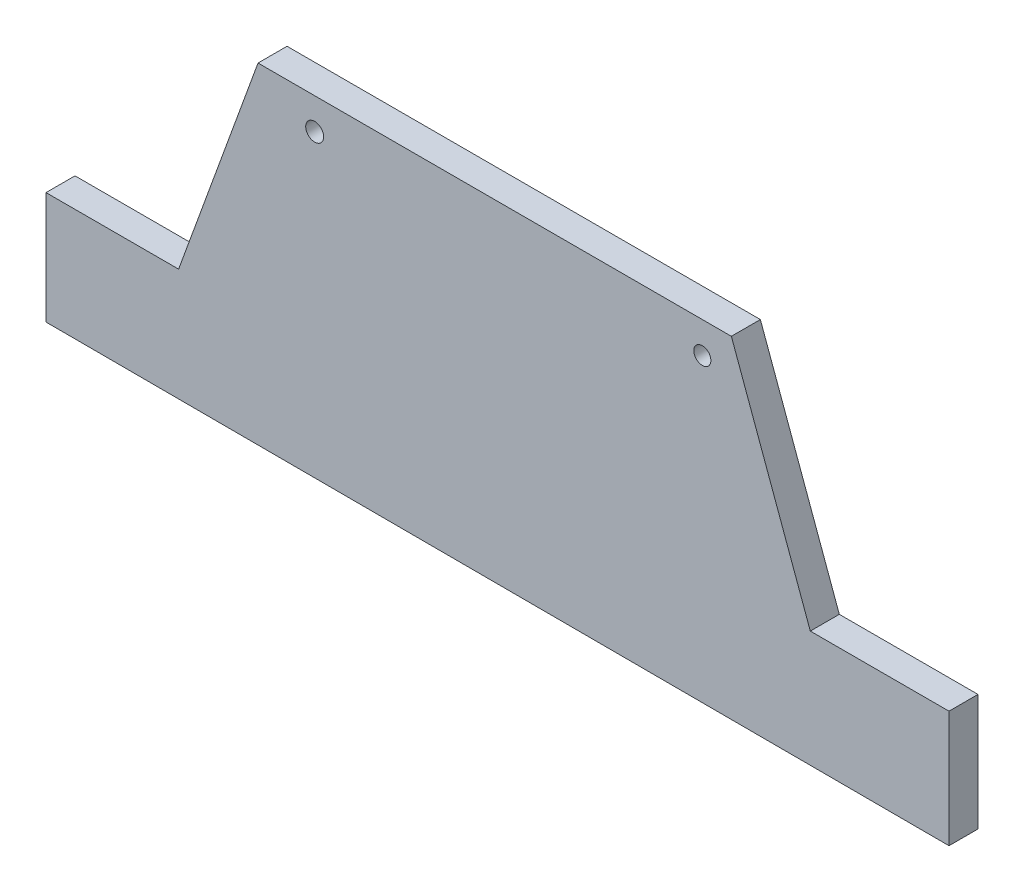
ISO-10303-21;
HEADER;
FILE_DESCRIPTION(('STEP AP214'),'2;1');
FILE_NAME('part.step','',(''),(''),'','','');
FILE_SCHEMA(('AUTOMOTIVE_DESIGN { 1 0 10303 214 1 1 1 1 }'));
ENDSEC;
DATA;
#1=APPLICATION_CONTEXT('core data for automotive mechanical design processes');
#2=APPLICATION_PROTOCOL_DEFINITION('international standard','automotive_design',2000,#1);
#3=PRODUCT_CONTEXT('',#1,'mechanical');
#4=PRODUCT('Part','Part','',(#3));
#5=PRODUCT_RELATED_PRODUCT_CATEGORY('part','',(#4));
#6=PRODUCT_DEFINITION_FORMATION('','',#4);
#7=PRODUCT_DEFINITION_CONTEXT('part definition',#1,'design');
#8=PRODUCT_DEFINITION('design','',#6,#7);
#9=PRODUCT_DEFINITION_SHAPE('','',#8);
#10=(LENGTH_UNIT() NAMED_UNIT(*) SI_UNIT(.MILLI.,.METRE.));
#11=(NAMED_UNIT(*) PLANE_ANGLE_UNIT() SI_UNIT($,.RADIAN.));
#12=(NAMED_UNIT(*) SI_UNIT($,.STERADIAN.) SOLID_ANGLE_UNIT());
#13=UNCERTAINTY_MEASURE_WITH_UNIT(LENGTH_MEASURE(1.E-05),#10,'distance_accuracy_value','');
#14=(GEOMETRIC_REPRESENTATION_CONTEXT(3) GLOBAL_UNCERTAINTY_ASSIGNED_CONTEXT((#13)) GLOBAL_UNIT_ASSIGNED_CONTEXT((#10,
#11,#12)) REPRESENTATION_CONTEXT('',''));
#15=CARTESIAN_POINT('',(0.,0.,0.));
#16=DIRECTION('',(0.,0.,1.));
#17=DIRECTION('',(1.,0.,0.));
#18=AXIS2_PLACEMENT_3D('',#15,#16,#17);
#19=CARTESIAN_POINT('',(167.483444874726,61.263371923883,-0.0001));
#20=DIRECTION('',(0.939142859872828,0.343526838471008,0.));
#21=DIRECTION('',(-0.343526838471008,0.939142859872828,0.));
#22=AXIS2_PLACEMENT_3D('',#19,#20,#21);
#23=PLANE('',#22);
#24=DIRECTION('',(0.,0.,1.));
#25=VECTOR('',#24,1.);
#26=CARTESIAN_POINT('',(136.012624896901,147.299141379528,-0.0001));
#27=LINE('',#26,#25);
#28=CARTESIAN_POINT('',(136.012624896901,147.299141379528,-0.0001));
#29=VERTEX_POINT('',#28);
#30=CARTESIAN_POINT('',(136.012624896901,147.299141379528,12.9338467982234));
#31=VERTEX_POINT('',#30);
#32=EDGE_CURVE('E41',#29,#31,#27,.T.);
#33=ORIENTED_EDGE('',*,*,#32,.T.);
#34=DIRECTION('',(-0.343526838471008,0.939142859872828,0.));
#35=VECTOR('',#34,1.);
#36=CARTESIAN_POINT('',(167.483444874726,61.263371923883,12.9338467982234));
#37=LINE('',#36,#35);
#38=CARTESIAN_POINT('',(171.212226027653,51.06953026835,12.9338467982234));
#39=VERTEX_POINT('',#38);
#40=EDGE_CURVE('E102',#39,#31,#37,.T.);
#41=ORIENTED_EDGE('',*,*,#40,.F.);
#42=DIRECTION('',(0.,0.,1.));
#43=VECTOR('',#42,1.);
#44=CARTESIAN_POINT('',(171.212226027653,51.06953026835,-0.0001));
#45=LINE('',#44,#43);
#46=CARTESIAN_POINT('',(171.212226027653,51.06953026835,-0.0001));
#47=VERTEX_POINT('',#46);
#48=EDGE_CURVE('E11',#47,#39,#45,.T.);
#49=ORIENTED_EDGE('',*,*,#48,.F.);
#50=DIRECTION('',(-0.343526838471008,0.939142859872828,0.));
#51=VECTOR('',#50,1.);
#52=CARTESIAN_POINT('',(167.483444874726,61.263371923883,-0.0001));
#53=LINE('',#52,#51);
#54=EDGE_CURVE('E103',#47,#29,#53,.T.);
#55=ORIENTED_EDGE('',*,*,#54,.T.);
#56=EDGE_LOOP('',(#33,#41,#49,#55));
#57=FACE_BOUND('',#56,.T.);
#58=ADVANCED_FACE('F37',(#57),#23,.T.);
#59=CARTESIAN_POINT('',(0.,51.0695302683499,-0.0001));
#60=DIRECTION('',(0.,1.,0.));
#61=DIRECTION('',(-1.,0.,0.));
#62=AXIS2_PLACEMENT_3D('',#59,#60,#61);
#63=PLANE('',#62);
#64=ORIENTED_EDGE('',*,*,#48,.T.);
#65=DIRECTION('',(-1.,0.,0.));
#66=VECTOR('',#65,1.);
#67=CARTESIAN_POINT('',(0.,51.0695302683499,12.9338467982234));
#68=LINE('',#67,#66);
#69=CARTESIAN_POINT('',(233.044157252322,51.06953026835,12.9338467982234));
#70=VERTEX_POINT('',#69);
#71=EDGE_CURVE('E121',#70,#39,#68,.T.);
#72=ORIENTED_EDGE('',*,*,#71,.F.);
#73=DIRECTION('',(0.,0.,1.));
#74=VECTOR('',#73,1.);
#75=CARTESIAN_POINT('',(233.044157252322,51.06953026835,-0.0001));
#76=LINE('',#75,#74);
#77=CARTESIAN_POINT('',(233.044157252322,51.06953026835,-0.0001));
#78=VERTEX_POINT('',#77);
#79=EDGE_CURVE('E46',#78,#70,#76,.T.);
#80=ORIENTED_EDGE('',*,*,#79,.F.);
#81=DIRECTION('',(-1.,0.,0.));
#82=VECTOR('',#81,1.);
#83=CARTESIAN_POINT('',(0.,51.0695302683499,-0.0001));
#84=LINE('',#83,#82);
#85=EDGE_CURVE('E108',#78,#47,#84,.T.);
#86=ORIENTED_EDGE('',*,*,#85,.T.);
#87=EDGE_LOOP('',(#64,#72,#80,#86));
#88=FACE_BOUND('',#87,.T.);
#89=ADVANCED_FACE('F194',(#88),#63,.T.);
#90=CARTESIAN_POINT('',(233.044157252322,0.,-0.0001));
#91=DIRECTION('',(1.,0.,0.));
#92=DIRECTION('',(0.,0.,-1.));
#93=AXIS2_PLACEMENT_3D('',#90,#91,#92);
#94=PLANE('',#93);
#95=ORIENTED_EDGE('',*,*,#79,.T.);
#96=DIRECTION('',(0.,1.,0.));
#97=VECTOR('',#96,1.);
#98=CARTESIAN_POINT('',(233.044157252322,0.,12.9338467982234));
#99=LINE('',#98,#97);
#100=CARTESIAN_POINT('',(233.044157252322,-0.895163773013796,12.9338467982234));
#101=VERTEX_POINT('',#100);
#102=EDGE_CURVE('E139',#101,#70,#99,.T.);
#103=ORIENTED_EDGE('',*,*,#102,.F.);
#104=DIRECTION('',(0.,0.,1.));
#105=VECTOR('',#104,1.);
#106=CARTESIAN_POINT('',(233.044157252322,-0.895163773013796,-0.0001));
#107=LINE('',#106,#105);
#108=CARTESIAN_POINT('',(233.044157252322,-0.895163773013796,-0.0001));
#109=VERTEX_POINT('',#108);
#110=EDGE_CURVE('E166',#109,#101,#107,.T.);
#111=ORIENTED_EDGE('',*,*,#110,.F.);
#112=DIRECTION('',(0.,1.,0.));
#113=VECTOR('',#112,1.);
#114=CARTESIAN_POINT('',(233.044157252322,0.,-0.0001));
#115=LINE('',#114,#113);
#116=EDGE_CURVE('E162',#109,#78,#115,.T.);
#117=ORIENTED_EDGE('',*,*,#116,.T.);
#118=EDGE_LOOP('',(#95,#103,#111,#117));
#119=FACE_BOUND('',#118,.T.);
#120=ADVANCED_FACE('F189',(#119),#94,.T.);
#121=CARTESIAN_POINT('',(-0.000838239385691122,-0.376998239181795,-0.0001));
#122=DIRECTION('',(-0.0022234515351859,-0.99999752812858,0.));
#123=DIRECTION('',(0.99999752812858,-0.0022234515351859,0.));
#124=AXIS2_PLACEMENT_3D('',#121,#122,#123);
#125=PLANE('',#124);
#126=ORIENTED_EDGE('',*,*,#110,.T.);
#127=DIRECTION('',(0.99999752812858,-0.0022234515351859,0.));
#128=VECTOR('',#127,1.);
#129=CARTESIAN_POINT('',(-0.000838239385691122,-0.376998239181795,12.9338467982234));
#130=LINE('',#129,#128);
#131=CARTESIAN_POINT('',(-169.555830252784,0.,12.9338467982234));
#132=VERTEX_POINT('',#131);
#133=EDGE_CURVE('E136',#132,#101,#130,.T.);
#134=ORIENTED_EDGE('',*,*,#133,.F.);
#135=DIRECTION('',(0.,0.,1.));
#136=VECTOR('',#135,1.);
#137=CARTESIAN_POINT('',(-169.555830252784,0.,-0.0001));
#138=LINE('',#137,#136);
#139=CARTESIAN_POINT('',(-169.555830252784,0.,-0.0001));
#140=VERTEX_POINT('',#139);
#141=EDGE_CURVE('E168',#140,#132,#138,.T.);
#142=ORIENTED_EDGE('',*,*,#141,.F.);
#143=DIRECTION('',(0.99999752812858,-0.0022234515351859,0.));
#144=VECTOR('',#143,1.);
#145=CARTESIAN_POINT('',(-0.000838239385691122,-0.376998239181795,-0.0001));
#146=LINE('',#145,#144);
#147=EDGE_CURVE('E159',#140,#109,#146,.T.);
#148=ORIENTED_EDGE('',*,*,#147,.T.);
#149=EDGE_LOOP('',(#126,#134,#142,#148));
#150=FACE_BOUND('',#149,.T.);
#151=ADVANCED_FACE('F201',(#150),#125,.T.);
#152=CARTESIAN_POINT('',(-169.555830252784,0.,-0.0001));
#153=DIRECTION('',(1.,0.,0.));
#154=DIRECTION('',(0.,0.,-1.));
#155=AXIS2_PLACEMENT_3D('',#152,#153,#154);
#156=PLANE('',#155);
#157=ORIENTED_EDGE('',*,*,#141,.T.);
#158=DIRECTION('',(0.,1.,0.));
#159=VECTOR('',#158,1.);
#160=CARTESIAN_POINT('',(-169.555830252784,0.,12.9338467982234));
#161=LINE('',#160,#159);
#162=CARTESIAN_POINT('',(-169.555830252784,50.,12.9338467982234));
#163=VERTEX_POINT('',#162);
#164=EDGE_CURVE('E133',#132,#163,#161,.T.);
#165=ORIENTED_EDGE('',*,*,#164,.T.);
#166=DIRECTION('',(0.,0.,1.));
#167=VECTOR('',#166,1.);
#168=CARTESIAN_POINT('',(-169.555830252784,50.,-0.0001));
#169=LINE('',#168,#167);
#170=CARTESIAN_POINT('',(-169.555830252784,50.,-0.0001));
#171=VERTEX_POINT('',#170);
#172=EDGE_CURVE('E170',#171,#163,#169,.T.);
#173=ORIENTED_EDGE('',*,*,#172,.F.);
#174=DIRECTION('',(0.,1.,0.));
#175=VECTOR('',#174,1.);
#176=CARTESIAN_POINT('',(-169.555830252784,0.,-0.0001));
#177=LINE('',#176,#175);
#178=EDGE_CURVE('E156',#140,#171,#177,.T.);
#179=ORIENTED_EDGE('',*,*,#178,.F.);
#180=EDGE_LOOP('',(#157,#165,#173,#179));
#181=FACE_BOUND('',#180,.T.);
#182=ADVANCED_FACE('F183',(#181),#156,.F.);
#183=CARTESIAN_POINT('',(0.,50.,-0.0001));
#184=DIRECTION('',(0.,-1.,0.));
#185=DIRECTION('',(0.,0.,-1.));
#186=AXIS2_PLACEMENT_3D('',#183,#184,#185);
#187=PLANE('',#186);
#188=ORIENTED_EDGE('',*,*,#172,.T.);
#189=DIRECTION('',(1.,0.,0.));
#190=VECTOR('',#189,1.);
#191=CARTESIAN_POINT('',(0.,50.,12.9338467982234));
#192=LINE('',#191,#190);
#193=CARTESIAN_POINT('',(-110.431982128087,50.,12.9338467982234));
#194=VERTEX_POINT('',#193);
#195=EDGE_CURVE('E130',#163,#194,#192,.T.);
#196=ORIENTED_EDGE('',*,*,#195,.T.);
#197=DIRECTION('',(0.,0.,1.));
#198=VECTOR('',#197,1.);
#199=CARTESIAN_POINT('',(-110.431982128087,50.,-0.0001));
#200=LINE('',#199,#198);
#201=CARTESIAN_POINT('',(-110.431982128087,50.,-0.0001));
#202=VERTEX_POINT('',#201);
#203=EDGE_CURVE('E172',#202,#194,#200,.T.);
#204=ORIENTED_EDGE('',*,*,#203,.F.);
#205=DIRECTION('',(1.,0.,0.));
#206=VECTOR('',#205,1.);
#207=CARTESIAN_POINT('',(0.,50.,-0.0001));
#208=LINE('',#207,#206);
#209=EDGE_CURVE('E153',#171,#202,#208,.T.);
#210=ORIENTED_EDGE('',*,*,#209,.F.);
#211=EDGE_LOOP('',(#188,#196,#204,#210));
#212=FACE_BOUND('',#211,.T.);
#213=ADVANCED_FACE('F179',(#212),#187,.F.);
#214=CARTESIAN_POINT('',(-113.583584432125,41.341043834555,-0.0001));
#215=DIRECTION('',(0.93969262078591,-0.342020143325665,0.));
#216=DIRECTION('',(0.342020143325665,0.93969262078591,0.));
#217=AXIS2_PLACEMENT_3D('',#214,#215,#216);
#218=PLANE('',#217);
#219=ORIENTED_EDGE('',*,*,#203,.T.);
#220=DIRECTION('',(0.342020143325665,0.93969262078591,0.));
#221=VECTOR('',#220,1.);
#222=CARTESIAN_POINT('',(-113.583584432125,41.341043834555,12.9338467982234));
#223=LINE('',#222,#221);
#224=CARTESIAN_POINT('',(-75.0179908462803,147.299141379528,12.9338467982234));
#225=VERTEX_POINT('',#224);
#226=EDGE_CURVE('E116',#194,#225,#223,.T.);
#227=ORIENTED_EDGE('',*,*,#226,.T.);
#228=DIRECTION('',(0.,0.,1.));
#229=VECTOR('',#228,1.);
#230=CARTESIAN_POINT('',(-75.0179908462803,147.299141379528,-0.0001));
#231=LINE('',#230,#229);
#232=CARTESIAN_POINT('',(-75.0179908462803,147.299141379528,-0.0001));
#233=VERTEX_POINT('',#232);
#234=EDGE_CURVE('E107',#233,#225,#231,.T.);
#235=ORIENTED_EDGE('',*,*,#234,.F.);
#236=DIRECTION('',(0.342020143325665,0.93969262078591,0.));
#237=VECTOR('',#236,1.);
#238=CARTESIAN_POINT('',(-113.583584432125,41.341043834555,-0.0001));
#239=LINE('',#238,#237);
#240=EDGE_CURVE('E151',#202,#233,#239,.T.);
#241=ORIENTED_EDGE('',*,*,#240,.F.);
#242=EDGE_LOOP('',(#219,#227,#235,#241));
#243=FACE_BOUND('',#242,.T.);
#244=ADVANCED_FACE('F175',(#243),#218,.F.);
#245=CARTESIAN_POINT('',(-49.7678283916644,133.392636667386,-0.0001));
#246=DIRECTION('',(0.,0.,1.));
#247=DIRECTION('',(1.,0.,0.));
#248=AXIS2_PLACEMENT_3D('',#245,#246,#247);
#249=CYLINDRICAL_SURFACE('',#248,4.00000000000001);
#250=CARTESIAN_POINT('',(-49.7678283916644,133.392636667386,-0.0001));
#251=DIRECTION('',(0.,0.,1.));
#252=DIRECTION('',(1.,0.,0.));
#253=AXIS2_PLACEMENT_3D('',#250,#251,#252);
#254=CIRCLE('',#253,4.00000000000001);
#255=CARTESIAN_POINT('',(-45.7678283916644,133.392636667386,-0.0001));
#256=VERTEX_POINT('',#255);
#257=EDGE_CURVE('E145',#256,#256,#254,.T.);
#258=ORIENTED_EDGE('',*,*,#257,.F.);
#259=EDGE_LOOP('',(#258));
#260=FACE_BOUND('',#259,.T.);
#261=CARTESIAN_POINT('',(-49.7678283916644,133.392636667386,12.9338467982234));
#262=DIRECTION('',(0.,0.,1.));
#263=DIRECTION('',(1.,0.,0.));
#264=AXIS2_PLACEMENT_3D('',#261,#262,#263);
#265=CIRCLE('',#264,4.00000000000001);
#266=CARTESIAN_POINT('',(-45.7678283916644,133.392636667386,12.9338467982234));
#267=VERTEX_POINT('',#266);
#268=EDGE_CURVE('E122',#267,#267,#265,.T.);
#269=ORIENTED_EDGE('',*,*,#268,.T.);
#270=EDGE_LOOP('',(#269));
#271=FACE_BOUND('',#270,.T.);
#272=ADVANCED_FACE('F215',(#260,#271),#249,.F.);
#273=CARTESIAN_POINT('',(123.066759463111,133.392636667386,-0.0001));
#274=DIRECTION('',(0.,0.,1.));
#275=DIRECTION('',(1.,0.,0.));
#276=AXIS2_PLACEMENT_3D('',#273,#274,#275);
#277=CYLINDRICAL_SURFACE('',#276,3.81750849365083);
#278=CARTESIAN_POINT('',(123.066759463111,133.392636667386,-0.0001));
#279=DIRECTION('',(0.,0.,1.));
#280=DIRECTION('',(1.,0.,0.));
#281=AXIS2_PLACEMENT_3D('',#278,#279,#280);
#282=CIRCLE('',#281,3.81750849365083);
#283=CARTESIAN_POINT('',(126.884267956762,133.392636667386,-0.0001));
#284=VERTEX_POINT('',#283);
#285=EDGE_CURVE('E142',#284,#284,#282,.T.);
#286=ORIENTED_EDGE('',*,*,#285,.F.);
#287=EDGE_LOOP('',(#286));
#288=FACE_BOUND('',#287,.T.);
#289=CARTESIAN_POINT('',(123.066759463111,133.392636667386,12.9338467982234));
#290=DIRECTION('',(0.,0.,1.));
#291=DIRECTION('',(1.,0.,0.));
#292=AXIS2_PLACEMENT_3D('',#289,#290,#291);
#293=CIRCLE('',#292,3.81750849365083);
#294=CARTESIAN_POINT('',(126.884267956762,133.392636667386,12.9338467982234));
#295=VERTEX_POINT('',#294);
#296=EDGE_CURVE('E125',#295,#295,#293,.T.);
#297=ORIENTED_EDGE('',*,*,#296,.T.);
#298=EDGE_LOOP('',(#297));
#299=FACE_BOUND('',#298,.T.);
#300=ADVANCED_FACE('F39',(#288,#299),#277,.F.);
#301=CARTESIAN_POINT('',(0.,147.299141379528,-0.0001));
#302=DIRECTION('',(0.,1.,0.));
#303=DIRECTION('',(0.,0.,1.));
#304=AXIS2_PLACEMENT_3D('',#301,#302,#303);
#305=PLANE('',#304);
#306=ORIENTED_EDGE('',*,*,#234,.T.);
#307=DIRECTION('',(-1.,0.,0.));
#308=VECTOR('',#307,1.);
#309=CARTESIAN_POINT('',(0.,147.299141379528,12.9338467982234));
#310=LINE('',#309,#308);
#311=EDGE_CURVE('E110',#31,#225,#310,.T.);
#312=ORIENTED_EDGE('',*,*,#311,.F.);
#313=ORIENTED_EDGE('',*,*,#32,.F.);
#314=DIRECTION('',(-1.,0.,0.));
#315=VECTOR('',#314,1.);
#316=CARTESIAN_POINT('',(0.,147.299141379528,-0.0001));
#317=LINE('',#316,#315);
#318=EDGE_CURVE('E149',#29,#233,#317,.T.);
#319=ORIENTED_EDGE('',*,*,#318,.T.);
#320=EDGE_LOOP('',(#306,#312,#313,#319));
#321=FACE_BOUND('',#320,.T.);
#322=ADVANCED_FACE('F111',(#321),#305,.T.);
#323=CARTESIAN_POINT('',(0.,0.,-0.0001));
#324=DIRECTION('',(0.,0.,1.));
#325=DIRECTION('',(1.,0.,0.));
#326=AXIS2_PLACEMENT_3D('',#323,#324,#325);
#327=PLANE('',#326);
#328=ORIENTED_EDGE('',*,*,#285,.T.);
#329=EDGE_LOOP('',(#328));
#330=FACE_BOUND('',#329,.T.);
#331=ORIENTED_EDGE('',*,*,#257,.T.);
#332=EDGE_LOOP('',(#331));
#333=FACE_BOUND('',#332,.T.);
#334=ORIENTED_EDGE('',*,*,#54,.F.);
#335=ORIENTED_EDGE('',*,*,#85,.F.);
#336=ORIENTED_EDGE('',*,*,#116,.F.);
#337=ORIENTED_EDGE('',*,*,#147,.F.);
#338=ORIENTED_EDGE('',*,*,#178,.T.);
#339=ORIENTED_EDGE('',*,*,#209,.T.);
#340=ORIENTED_EDGE('',*,*,#240,.T.);
#341=ORIENTED_EDGE('',*,*,#318,.F.);
#342=EDGE_LOOP('',(#334,#335,#336,#337,#338,#339,#340,#341));
#343=FACE_BOUND('',#342,.T.);
#344=ADVANCED_FACE('F193',(#330,#333,#343),#327,.F.);
#345=CARTESIAN_POINT('',(0.,0.,12.9338467982234));
#346=DIRECTION('',(0.,0.,1.));
#347=DIRECTION('',(1.,0.,0.));
#348=AXIS2_PLACEMENT_3D('',#345,#346,#347);
#349=PLANE('',#348);
#350=ORIENTED_EDGE('',*,*,#296,.F.);
#351=EDGE_LOOP('',(#350));
#352=FACE_BOUND('',#351,.T.);
#353=ORIENTED_EDGE('',*,*,#268,.F.);
#354=EDGE_LOOP('',(#353));
#355=FACE_BOUND('',#354,.T.);
#356=ORIENTED_EDGE('',*,*,#40,.T.);
#357=ORIENTED_EDGE('',*,*,#311,.T.);
#358=ORIENTED_EDGE('',*,*,#226,.F.);
#359=ORIENTED_EDGE('',*,*,#195,.F.);
#360=ORIENTED_EDGE('',*,*,#164,.F.);
#361=ORIENTED_EDGE('',*,*,#133,.T.);
#362=ORIENTED_EDGE('',*,*,#102,.T.);
#363=ORIENTED_EDGE('',*,*,#71,.T.);
#364=EDGE_LOOP('',(#356,#357,#358,#359,#360,#361,#362,#363));
#365=FACE_BOUND('',#364,.T.);
#366=ADVANCED_FACE('F119',(#352,#355,#365),#349,.T.);
#367=CLOSED_SHELL('',(#58,#89,#120,#151,#182,#213,#244,#272,#300,#322,#344,#366));
#368=MANIFOLD_SOLID_BREP('B2',#367);
#369=ADVANCED_BREP_SHAPE_REPRESENTATION('',(#18,#368),#14);
#370=SHAPE_DEFINITION_REPRESENTATION(#9,#369);
ENDSEC;
END-ISO-10303-21;
